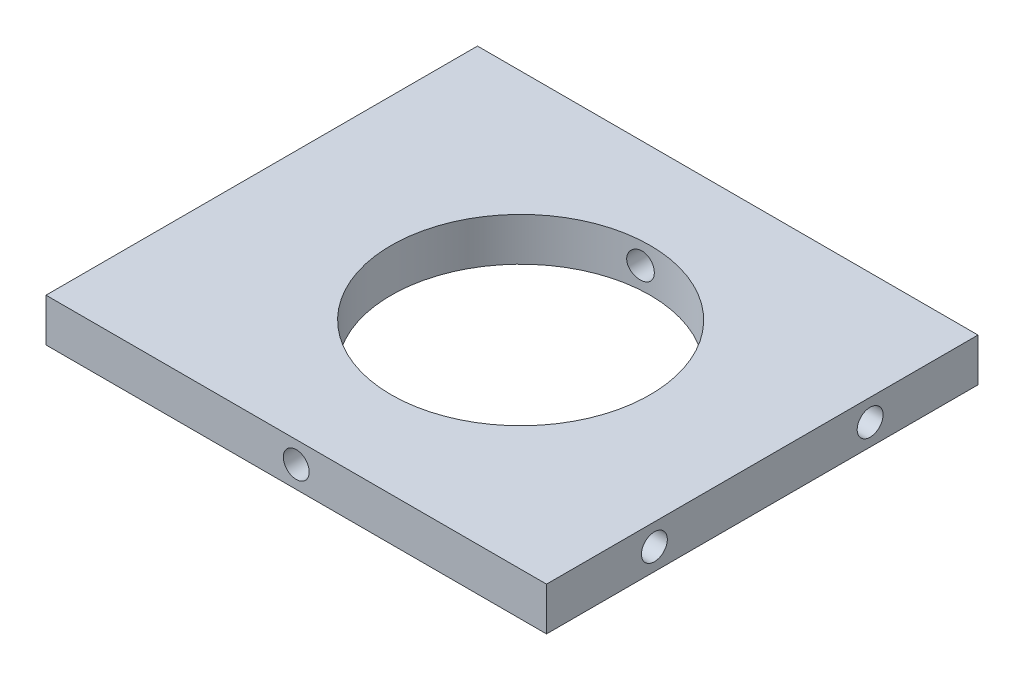
ISO-10303-21;
HEADER;
FILE_DESCRIPTION(('STEP AP214'),'2;1');
FILE_NAME('part.step','',(''),(''),'','','');
FILE_SCHEMA(('AUTOMOTIVE_DESIGN { 1 0 10303 214 1 1 1 1 }'));
ENDSEC;
DATA;
#1=APPLICATION_CONTEXT('core data for automotive mechanical design processes');
#2=APPLICATION_PROTOCOL_DEFINITION('international standard','automotive_design',2000,#1);
#3=PRODUCT_CONTEXT('',#1,'mechanical');
#4=PRODUCT('Part','Part','',(#3));
#5=PRODUCT_RELATED_PRODUCT_CATEGORY('part','',(#4));
#6=PRODUCT_DEFINITION_FORMATION('','',#4);
#7=PRODUCT_DEFINITION_CONTEXT('part definition',#1,'design');
#8=PRODUCT_DEFINITION('design','',#6,#7);
#9=PRODUCT_DEFINITION_SHAPE('','',#8);
#10=(LENGTH_UNIT() NAMED_UNIT(*) SI_UNIT(.MILLI.,.METRE.));
#11=(NAMED_UNIT(*) PLANE_ANGLE_UNIT() SI_UNIT($,.RADIAN.));
#12=(NAMED_UNIT(*) SI_UNIT($,.STERADIAN.) SOLID_ANGLE_UNIT());
#13=UNCERTAINTY_MEASURE_WITH_UNIT(LENGTH_MEASURE(1.E-05),#10,'distance_accuracy_value','');
#14=(GEOMETRIC_REPRESENTATION_CONTEXT(3) GLOBAL_UNCERTAINTY_ASSIGNED_CONTEXT((#13)) GLOBAL_UNIT_ASSIGNED_CONTEXT((#10,
#11,#12)) REPRESENTATION_CONTEXT('',''));
#15=CARTESIAN_POINT('',(0.,0.,0.));
#16=DIRECTION('',(0.,0.,1.));
#17=DIRECTION('',(1.,0.,0.));
#18=AXIS2_PLACEMENT_3D('',#15,#16,#17);
#19=CARTESIAN_POINT('',(-5.5,-45.,50.));
#20=DIRECTION('',(1.,0.,0.));
#21=DIRECTION('',(0.,0.,-1.));
#22=AXIS2_PLACEMENT_3D('',#19,#20,#21);
#23=PLANE('',#22);
#24=CARTESIAN_POINT('',(-5.5,-47.5,12.5));
#25=DIRECTION('',(-1.,0.,0.));
#26=DIRECTION('',(0.,0.,1.));
#27=AXIS2_PLACEMENT_3D('',#24,#25,#26);
#28=CIRCLE('',#27,1.5);
#29=CARTESIAN_POINT('',(-5.5,-47.5,14.));
#30=VERTEX_POINT('',#29);
#31=EDGE_CURVE('E195',#30,#30,#28,.T.);
#32=ORIENTED_EDGE('',*,*,#31,.F.);
#33=EDGE_LOOP('',(#32));
#34=FACE_BOUND('',#33,.T.);
#35=CARTESIAN_POINT('',(-5.5,-47.5,37.5));
#36=DIRECTION('',(-1.,0.,0.));
#37=DIRECTION('',(0.,0.,1.));
#38=AXIS2_PLACEMENT_3D('',#35,#36,#37);
#39=CIRCLE('',#38,1.5);
#40=CARTESIAN_POINT('',(-5.5,-47.5,39.));
#41=VERTEX_POINT('',#40);
#42=EDGE_CURVE('E198',#41,#41,#39,.T.);
#43=ORIENTED_EDGE('',*,*,#42,.F.);
#44=EDGE_LOOP('',(#43));
#45=FACE_BOUND('',#44,.T.);
#46=DIRECTION('',(0.,-1.,0.));
#47=VECTOR('',#46,1.);
#48=CARTESIAN_POINT('',(-5.5,-45.,0.));
#49=LINE('',#48,#47);
#50=CARTESIAN_POINT('',(-5.5,-45.,0.));
#51=VERTEX_POINT('',#50);
#52=CARTESIAN_POINT('',(-5.5,-50.,0.));
#53=VERTEX_POINT('',#52);
#54=EDGE_CURVE('E114',#51,#53,#49,.T.);
#55=ORIENTED_EDGE('',*,*,#54,.T.);
#56=DIRECTION('',(0.,0.,-1.));
#57=VECTOR('',#56,1.);
#58=CARTESIAN_POINT('',(-5.5,-50.,50.));
#59=LINE('',#58,#57);
#60=CARTESIAN_POINT('',(-5.5,-50.,50.));
#61=VERTEX_POINT('',#60);
#62=EDGE_CURVE('E11',#61,#53,#59,.T.);
#63=ORIENTED_EDGE('',*,*,#62,.F.);
#64=DIRECTION('',(0.,-1.,0.));
#65=VECTOR('',#64,1.);
#66=CARTESIAN_POINT('',(-5.5,-45.,50.));
#67=LINE('',#66,#65);
#68=CARTESIAN_POINT('',(-5.5,-45.,50.));
#69=VERTEX_POINT('',#68);
#70=EDGE_CURVE('E95',#69,#61,#67,.T.);
#71=ORIENTED_EDGE('',*,*,#70,.F.);
#72=DIRECTION('',(0.,0.,-1.));
#73=VECTOR('',#72,1.);
#74=CARTESIAN_POINT('',(-5.5,-45.,50.));
#75=LINE('',#74,#73);
#76=EDGE_CURVE('E62',#69,#51,#75,.T.);
#77=ORIENTED_EDGE('',*,*,#76,.T.);
#78=EDGE_LOOP('',(#55,#63,#71,#77));
#79=FACE_BOUND('',#78,.T.);
#80=ADVANCED_FACE('F38',(#34,#45,#79),#23,.F.);
#81=CARTESIAN_POINT('',(-5.5,-50.,50.));
#82=DIRECTION('',(0.,1.,0.));
#83=DIRECTION('',(0.,0.,1.));
#84=AXIS2_PLACEMENT_3D('',#81,#82,#83);
#85=PLANE('',#84);
#86=CARTESIAN_POINT('',(24.5,-50.,25.));
#87=DIRECTION('',(0.,1.,0.));
#88=DIRECTION('',(0.,0.,1.));
#89=AXIS2_PLACEMENT_3D('',#86,#87,#88);
#90=CIRCLE('',#89,15.);
#91=CARTESIAN_POINT('',(24.5,-50.,40.));
#92=VERTEX_POINT('',#91);
#93=EDGE_CURVE('E117',#92,#92,#90,.T.);
#94=ORIENTED_EDGE('',*,*,#93,.T.);
#95=EDGE_LOOP('',(#94));
#96=FACE_BOUND('',#95,.T.);
#97=DIRECTION('',(1.,0.,0.));
#98=VECTOR('',#97,1.);
#99=CARTESIAN_POINT('',(-5.5,-50.,0.));
#100=LINE('',#99,#98);
#101=CARTESIAN_POINT('',(52.5,-50.,0.));
#102=VERTEX_POINT('',#101);
#103=EDGE_CURVE('E101',#53,#102,#100,.T.);
#104=ORIENTED_EDGE('',*,*,#103,.T.);
#105=DIRECTION('',(0.,0.,-1.));
#106=VECTOR('',#105,1.);
#107=CARTESIAN_POINT('',(52.5,-50.,50.));
#108=LINE('',#107,#106);
#109=CARTESIAN_POINT('',(52.5,-50.,50.));
#110=VERTEX_POINT('',#109);
#111=EDGE_CURVE('E53',#110,#102,#108,.T.);
#112=ORIENTED_EDGE('',*,*,#111,.F.);
#113=DIRECTION('',(1.,0.,0.));
#114=VECTOR('',#113,1.);
#115=CARTESIAN_POINT('',(-5.5,-50.,50.));
#116=LINE('',#115,#114);
#117=EDGE_CURVE('E87',#61,#110,#116,.T.);
#118=ORIENTED_EDGE('',*,*,#117,.F.);
#119=ORIENTED_EDGE('',*,*,#62,.T.);
#120=EDGE_LOOP('',(#104,#112,#118,#119));
#121=FACE_BOUND('',#120,.T.);
#122=ADVANCED_FACE('F100',(#96,#121),#85,.F.);
#123=CARTESIAN_POINT('',(52.5,-45.,50.));
#124=DIRECTION('',(1.,0.,0.));
#125=DIRECTION('',(0.,0.,-1.));
#126=AXIS2_PLACEMENT_3D('',#123,#124,#125);
#127=PLANE('',#126);
#128=CARTESIAN_POINT('',(52.5,-47.5,37.5));
#129=DIRECTION('',(1.,0.,0.));
#130=DIRECTION('',(0.,0.,-1.));
#131=AXIS2_PLACEMENT_3D('',#128,#129,#130);
#132=CIRCLE('',#131,1.5);
#133=CARTESIAN_POINT('',(52.5,-47.5,36.));
#134=VERTEX_POINT('',#133);
#135=EDGE_CURVE('E232',#134,#134,#132,.T.);
#136=ORIENTED_EDGE('',*,*,#135,.F.);
#137=EDGE_LOOP('',(#136));
#138=FACE_BOUND('',#137,.T.);
#139=CARTESIAN_POINT('',(52.5,-47.5,12.5));
#140=DIRECTION('',(1.,0.,0.));
#141=DIRECTION('',(0.,0.,-1.));
#142=AXIS2_PLACEMENT_3D('',#139,#140,#141);
#143=CIRCLE('',#142,1.5);
#144=CARTESIAN_POINT('',(52.5,-47.5,11.));
#145=VERTEX_POINT('',#144);
#146=EDGE_CURVE('E240',#145,#145,#143,.T.);
#147=ORIENTED_EDGE('',*,*,#146,.F.);
#148=EDGE_LOOP('',(#147));
#149=FACE_BOUND('',#148,.T.);
#150=DIRECTION('',(0.,-1.,0.));
#151=VECTOR('',#150,1.);
#152=CARTESIAN_POINT('',(52.5,-45.,0.));
#153=LINE('',#152,#151);
#154=CARTESIAN_POINT('',(52.5,-45.,0.));
#155=VERTEX_POINT('',#154);
#156=EDGE_CURVE('E120',#155,#102,#153,.T.);
#157=ORIENTED_EDGE('',*,*,#156,.F.);
#158=DIRECTION('',(0.,0.,-1.));
#159=VECTOR('',#158,1.);
#160=CARTESIAN_POINT('',(52.5,-45.,50.));
#161=LINE('',#160,#159);
#162=CARTESIAN_POINT('',(52.5,-45.,50.));
#163=VERTEX_POINT('',#162);
#164=EDGE_CURVE('E76',#163,#155,#161,.T.);
#165=ORIENTED_EDGE('',*,*,#164,.F.);
#166=DIRECTION('',(0.,-1.,0.));
#167=VECTOR('',#166,1.);
#168=CARTESIAN_POINT('',(52.5,-45.,50.));
#169=LINE('',#168,#167);
#170=EDGE_CURVE('E94',#163,#110,#169,.T.);
#171=ORIENTED_EDGE('',*,*,#170,.T.);
#172=ORIENTED_EDGE('',*,*,#111,.T.);
#173=EDGE_LOOP('',(#157,#165,#171,#172));
#174=FACE_BOUND('',#173,.T.);
#175=ADVANCED_FACE('F106',(#138,#149,#174),#127,.T.);
#176=CARTESIAN_POINT('',(-5.5,-45.,50.));
#177=DIRECTION('',(0.,1.,0.));
#178=DIRECTION('',(0.,0.,1.));
#179=AXIS2_PLACEMENT_3D('',#176,#177,#178);
#180=PLANE('',#179);
#181=CARTESIAN_POINT('',(24.5,-45.,25.));
#182=DIRECTION('',(0.,1.,0.));
#183=DIRECTION('',(0.,0.,1.));
#184=AXIS2_PLACEMENT_3D('',#181,#182,#183);
#185=CIRCLE('',#184,15.);
#186=CARTESIAN_POINT('',(24.5,-45.,40.));
#187=VERTEX_POINT('',#186);
#188=EDGE_CURVE('E248',#187,#187,#185,.T.);
#189=ORIENTED_EDGE('',*,*,#188,.F.);
#190=EDGE_LOOP('',(#189));
#191=FACE_BOUND('',#190,.T.);
#192=DIRECTION('',(1.,0.,0.));
#193=VECTOR('',#192,1.);
#194=CARTESIAN_POINT('',(-5.5,-45.,0.));
#195=LINE('',#194,#193);
#196=EDGE_CURVE('E123',#51,#155,#195,.T.);
#197=ORIENTED_EDGE('',*,*,#196,.F.);
#198=ORIENTED_EDGE('',*,*,#76,.F.);
#199=DIRECTION('',(1.,0.,0.));
#200=VECTOR('',#199,1.);
#201=CARTESIAN_POINT('',(-5.5,-45.,50.));
#202=LINE('',#201,#200);
#203=EDGE_CURVE('E108',#69,#163,#202,.T.);
#204=ORIENTED_EDGE('',*,*,#203,.T.);
#205=ORIENTED_EDGE('',*,*,#164,.T.);
#206=EDGE_LOOP('',(#197,#198,#204,#205));
#207=FACE_BOUND('',#206,.T.);
#208=ADVANCED_FACE('F200',(#191,#207),#180,.T.);
#209=CARTESIAN_POINT('',(0.,0.,50.));
#210=DIRECTION('',(0.,0.,1.));
#211=DIRECTION('',(1.,0.,0.));
#212=AXIS2_PLACEMENT_3D('',#209,#210,#211);
#213=PLANE('',#212);
#214=CARTESIAN_POINT('',(23.5,-47.5,50.));
#215=DIRECTION('',(0.,0.,1.));
#216=DIRECTION('',(1.,0.,0.));
#217=AXIS2_PLACEMENT_3D('',#214,#215,#216);
#218=CIRCLE('',#217,1.5);
#219=CARTESIAN_POINT('',(25.,-47.5,50.));
#220=VERTEX_POINT('',#219);
#221=EDGE_CURVE('E222',#220,#220,#218,.T.);
#222=ORIENTED_EDGE('',*,*,#221,.F.);
#223=EDGE_LOOP('',(#222));
#224=FACE_BOUND('',#223,.T.);
#225=ORIENTED_EDGE('',*,*,#70,.T.);
#226=ORIENTED_EDGE('',*,*,#117,.T.);
#227=ORIENTED_EDGE('',*,*,#170,.F.);
#228=ORIENTED_EDGE('',*,*,#203,.F.);
#229=EDGE_LOOP('',(#225,#226,#227,#228));
#230=FACE_BOUND('',#229,.T.);
#231=ADVANCED_FACE('F91',(#224,#230),#213,.T.);
#232=CARTESIAN_POINT('',(0.,0.,0.));
#233=DIRECTION('',(0.,0.,1.));
#234=DIRECTION('',(1.,0.,0.));
#235=AXIS2_PLACEMENT_3D('',#232,#233,#234);
#236=PLANE('',#235);
#237=CARTESIAN_POINT('',(23.5,-47.5,0.));
#238=DIRECTION('',(0.,0.,1.));
#239=DIRECTION('',(1.,0.,0.));
#240=AXIS2_PLACEMENT_3D('',#237,#238,#239);
#241=CIRCLE('',#240,1.5);
#242=CARTESIAN_POINT('',(25.,-47.5,0.));
#243=VERTEX_POINT('',#242);
#244=EDGE_CURVE('E136',#243,#243,#241,.T.);
#245=ORIENTED_EDGE('',*,*,#244,.T.);
#246=EDGE_LOOP('',(#245));
#247=FACE_BOUND('',#246,.T.);
#248=ORIENTED_EDGE('',*,*,#54,.F.);
#249=ORIENTED_EDGE('',*,*,#196,.T.);
#250=ORIENTED_EDGE('',*,*,#156,.T.);
#251=ORIENTED_EDGE('',*,*,#103,.F.);
#252=EDGE_LOOP('',(#248,#249,#250,#251));
#253=FACE_BOUND('',#252,.T.);
#254=ADVANCED_FACE('F182',(#247,#253),#236,.F.);
#255=CARTESIAN_POINT('',(24.5,-50.,25.));
#256=DIRECTION('',(0.,1.,0.));
#257=DIRECTION('',(0.,0.,1.));
#258=AXIS2_PLACEMENT_3D('',#255,#256,#257);
#259=CYLINDRICAL_SURFACE('',#258,15.);
#260=CARTESIAN_POINT('',(24.5,-48.6180339887499,40.));
#261=CARTESIAN_POINT('',(24.562792353238,-48.5618659776974,39.9999999273094));
#262=CARTESIAN_POINT('',(24.6208838158503,-48.5003581564799,39.9996043563319));
#263=CARTESIAN_POINT('',(24.72595981168,-48.3684181847015,39.9983905695386));
#264=CARTESIAN_POINT('',(24.772931785864,-48.2979760797655,39.9975718791152));
#265=CARTESIAN_POINT('',(24.8543649479623,-48.1502338072453,39.99586905058));
#266=CARTESIAN_POINT('',(24.8888319928025,-48.0729368714198,39.9949849433416));
#267=CARTESIAN_POINT('',(24.9442939822402,-47.9136720731185,39.9934445105049));
#268=CARTESIAN_POINT('',(24.9652921021757,-47.8317053165315,39.9927881312359));
#269=CARTESIAN_POINT('',(24.9932381044238,-47.6653852355015,39.991894956042));
#270=CARTESIAN_POINT('',(25.0001822524607,-47.5810312827931,39.9916582716361));
#271=CARTESIAN_POINT('',(24.9998104507153,-47.4123520030367,39.9916706731326));
#272=CARTESIAN_POINT('',(24.9924940082127,-47.3280266770783,39.9919197758194));
#273=CARTESIAN_POINT('',(24.9638161431028,-47.1618456026428,39.9928341984516));
#274=CARTESIAN_POINT('',(24.9424617981782,-47.0799886314014,39.9934993086447));
#275=CARTESIAN_POINT('',(24.8863217141132,-46.9210199569291,39.9950504711979));
#276=CARTESIAN_POINT('',(24.8515359006039,-46.8439082799752,39.9959365247814));
#277=CARTESIAN_POINT('',(24.7694988309606,-46.6965791515574,39.9976347173306));
#278=CARTESIAN_POINT('',(24.7222416725437,-46.6263649861102,39.9984468210528));
#279=CARTESIAN_POINT('',(24.6166083457938,-46.4948639816127,39.9996394624362));
#280=CARTESIAN_POINT('',(24.5582322156506,-46.4335771119016,40.0000200015798));
#281=CARTESIAN_POINT('',(24.4320393526911,-46.3216914820977,39.9999784211476));
#282=CARTESIAN_POINT('',(24.3642257106856,-46.2710892363641,39.9995565637883));
#283=CARTESIAN_POINT('',(24.2210799042835,-46.1819898565089,39.9975771087919));
#284=CARTESIAN_POINT('',(24.1457478960958,-46.1434924709536,39.9960195347473));
#285=CARTESIAN_POINT('',(23.9899180446766,-46.0797715112282,39.9915266586073));
#286=CARTESIAN_POINT('',(23.9094332194227,-46.0545158613062,39.988594718639));
#287=CARTESIAN_POINT('',(23.7454392678804,-46.0178328573119,39.9812339758208));
#288=CARTESIAN_POINT('',(23.6619301757651,-46.0064053470377,39.9768051898798));
#289=CARTESIAN_POINT('',(23.4943230369783,-45.9976665937383,39.9664845056108));
#290=CARTESIAN_POINT('',(23.4102254049045,-46.0003462508765,39.9605935527908));
#291=CARTESIAN_POINT('',(23.2437533596228,-46.0196756779531,39.9475355154578));
#292=CARTESIAN_POINT('',(23.1613790012947,-46.0363258921081,39.9403683903723));
#293=CARTESIAN_POINT('',(23.0002148174492,-46.0832096888632,39.9250539333135));
#294=CARTESIAN_POINT('',(22.9214460800378,-46.1135141218067,39.9169016530286));
#295=CARTESIAN_POINT('',(22.770129740452,-46.1868514276487,39.9001124404489));
#296=CARTESIAN_POINT('',(22.6975824694957,-46.2298849776771,39.8914754823913));
#297=CARTESIAN_POINT('',(22.560210733606,-46.3278382495193,39.8742075878157));
#298=CARTESIAN_POINT('',(22.4954454068788,-46.3828410293132,39.865577139024));
#299=CARTESIAN_POINT('',(22.3760681607444,-46.5030290060947,39.8489916746371));
#300=CARTESIAN_POINT('',(22.321456317729,-46.5682142796855,39.841036664124));
#301=CARTESIAN_POINT('',(22.2239861605324,-46.7069241677782,39.8264020065275));
#302=CARTESIAN_POINT('',(22.1811210921386,-46.780443955538,39.8197216272249));
#303=CARTESIAN_POINT('',(22.1083830987965,-46.9337829426933,39.8081576293496));
#304=CARTESIAN_POINT('',(22.0785092560552,-47.0136016966138,39.8032738838537));
#305=CARTESIAN_POINT('',(22.0329217592396,-47.1763550590977,39.7957445669148));
#306=CARTESIAN_POINT('',(22.0170587060804,-47.2592467230113,39.793075400165));
#307=CARTESIAN_POINT('',(21.99944001645,-47.4265556839183,39.7901075765534));
#308=CARTESIAN_POINT('',(21.9976833974087,-47.5109728742422,39.7898087545877));
#309=CARTESIAN_POINT('',(22.0082758882822,-47.6780268937381,39.7915968474477));
#310=CARTESIAN_POINT('',(22.0204820432474,-47.7606730965288,39.7936595841268));
#311=CARTESIAN_POINT('',(22.0583925626577,-47.9227202250515,39.7999634598376));
#312=CARTESIAN_POINT('',(22.0840970129419,-48.0021211301425,39.8042046127225));
#313=CARTESIAN_POINT('',(22.1483032340545,-48.1556317105165,39.8145393271029));
#314=CARTESIAN_POINT('',(22.1868319027658,-48.2297298633808,39.8206367797408));
#315=CARTESIAN_POINT('',(22.2755567105231,-48.3704352687845,39.8342124511775));
#316=CARTESIAN_POINT('',(22.3257536560549,-48.4370420030609,39.8416907654112));
#317=CARTESIAN_POINT('',(22.4370693925022,-48.5617176741496,39.8575740693727));
#318=CARTESIAN_POINT('',(22.4983104849109,-48.6196761614701,39.8659889844142));
#319=CARTESIAN_POINT('',(22.6296001439708,-48.7245254908278,39.8830769488825));
#320=CARTESIAN_POINT('',(22.6996492013782,-48.7714157157517,39.891750012672));
#321=CARTESIAN_POINT('',(22.8472614104589,-48.8531855360378,39.9088569265127));
#322=CARTESIAN_POINT('',(22.9248835810385,-48.8879592273636,39.9172881037536));
#323=CARTESIAN_POINT('',(23.0849570892867,-48.943927864651,39.9333223956186));
#324=CARTESIAN_POINT('',(23.1674082006577,-48.965123446366,39.9409255489985));
#325=CARTESIAN_POINT('',(23.3346056759678,-48.9932561545366,39.9548946501727));
#326=CARTESIAN_POINT('',(23.4193460068746,-49.0002276394919,39.9612635455413));
#327=CARTESIAN_POINT('',(23.588904796731,-48.9997610144627,39.9725456864663));
#328=CARTESIAN_POINT('',(23.6737232670143,-48.9923203055756,39.9774586692985));
#329=CARTESIAN_POINT('',(23.8403540340811,-48.9633056593774,39.9857192995042));
#330=CARTESIAN_POINT('',(23.9221834167737,-48.9418325836234,39.9890778278578));
#331=CARTESIAN_POINT('',(24.0810523350006,-48.8854484515661,39.9943586171885));
#332=CARTESIAN_POINT('',(24.1580971248861,-48.8505524503972,39.9962824802054));
#333=CARTESIAN_POINT('',(24.2797029674199,-48.7826155745908,39.9984597880573));
#334=CARTESIAN_POINT('',(24.3262741867071,-48.7531165454756,39.9990609731497));
#335=CARTESIAN_POINT('',(24.4158998136255,-48.6891835492231,39.9998311023475));
#336=CARTESIAN_POINT('',(24.4589542299064,-48.654749594224,40.000000047516));
#337=CARTESIAN_POINT('',(24.5,-48.6180339887499,40.));
#338=B_SPLINE_CURVE_WITH_KNOTS('',3,(#260,#261,#262,#263,#264,#265,#266,#267,#268,#269,#270,
#271,#272,#273,#274,#275,#276,#277,#278,#279,#280,#281,#282,#283,#284,#285,#286,#287,#288,#289,
#290,#291,#292,#293,#294,#295,#296,#297,#298,#299,#300,#301,#302,#303,#304,#305,#306,#307,#308,
#309,#310,#311,#312,#313,#314,#315,#316,#317,#318,#319,#320,#321,#322,#323,#324,#325,#326,#327,
#328,#329,#330,#331,#332,#333,#334,#335,#336,#337),.UNSPECIFIED.,.T.,.F.,(4,2,2,2,2,2,2,2,2,2,2,
2,2,2,2,2,2,2,2,2,2,2,2,2,2,2,2,2,2,2,2,2,2,2,2,2,2,2,4),(0.,0.252543206012552,
0.505370303251981,0.758078830685047,1.0107277594349,1.2634438106295,1.51616859361576,
1.76876605449305,2.02136491400379,2.2740835354169,2.5268012888428,2.77943647043873,
3.03206640412767,3.28408152599207,3.53609380108175,3.78794353543168,4.03980127805724,
4.29298120960288,4.54617461156697,4.80118445355844,5.05619621408953,5.31106103770037,
5.56590785291206,5.81800319874273,6.07008098496437,6.3196008486299,6.56912229907351,
6.81917043593607,7.06923586072356,7.32226266989589,7.57530358329969,7.83050375721573,
8.08569198129116,8.34026306146166,8.59488005185742,8.84768674836169,9.1002107201396,
9.26529222026118,9.43037331434599),.UNSPECIFIED.);
#339=CARTESIAN_POINT('',(24.5,-48.6180339887499,40.));
#340=VERTEX_POINT('',#339);
#341=EDGE_CURVE('E41',#340,#340,#338,.T.);
#342=ORIENTED_EDGE('',*,*,#341,.T.);
#343=EDGE_LOOP('',(#342));
#344=FACE_BOUND('',#343,.T.);
#345=CARTESIAN_POINT('',(25.,-47.5,10.0083356494351));
#346=CARTESIAN_POINT('',(24.9999964070791,-47.5842499744961,10.0083349118921));
#347=CARTESIAN_POINT('',(24.9928786229047,-47.6685554591201,10.0080928964742));
#348=CARTESIAN_POINT('',(24.964585862334,-47.8348368758247,10.0071899661793));
#349=CARTESIAN_POINT('',(24.9433954392273,-47.9168101447469,10.0065285910318));
#350=CARTESIAN_POINT('',(24.8875624354346,-48.0760027863067,10.0049818002119));
#351=CARTESIAN_POINT('',(24.8529260300543,-48.1532243224277,10.0040964874517));
#352=CARTESIAN_POINT('',(24.7711906244292,-48.3007398392809,10.0023962417037));
#353=CARTESIAN_POINT('',(24.7240943522341,-48.3710353318311,10.0015812933617));
#354=CARTESIAN_POINT('',(24.6187504122749,-48.5027518519266,10.0003778129088));
#355=CARTESIAN_POINT('',(24.5604987516729,-48.5641696880463,9.99998943381575));
#356=CARTESIAN_POINT('',(24.434507814437,-48.676354536589,10.0000109816476));
#357=CARTESIAN_POINT('',(24.3667683329315,-48.7271213189636,10.0004209258132));
#358=CARTESIAN_POINT('',(24.2238475421744,-48.8164865821728,10.002372459673));
#359=CARTESIAN_POINT('',(24.1486777588008,-48.8551035323155,10.0039123197582));
#360=CARTESIAN_POINT('',(23.9929648679635,-48.9191805397952,10.0083698173944));
#361=CARTESIAN_POINT('',(23.9124218871837,-48.9446409072012,10.0112874224723));
#362=CARTESIAN_POINT('',(23.7484626265013,-48.9816590937206,10.0186146503521));
#363=CARTESIAN_POINT('',(23.6650533204193,-48.9932484953246,10.0230208543269));
#364=CARTESIAN_POINT('',(23.4975616761401,-49.0023409897194,10.0332984041684));
#365=CARTESIAN_POINT('',(23.4134793331329,-48.999843981751,10.039169760515));
#366=CARTESIAN_POINT('',(23.2468303259933,-48.9808623951708,10.0522052435257));
#367=CARTESIAN_POINT('',(23.1642672811478,-48.964347964132,10.0593721035229));
#368=CARTESIAN_POINT('',(23.0031360135907,-48.9178010130177,10.0746540147077));
#369=CARTESIAN_POINT('',(22.9245679894165,-48.8877678218399,10.0827691129532));
#370=CARTESIAN_POINT('',(22.7730326409861,-48.8147784316545,10.0995489048332));
#371=CARTESIAN_POINT('',(22.7001102670412,-48.7717297203582,10.1082171702816));
#372=CARTESIAN_POINT('',(22.5625230627467,-48.6739924742659,10.1254916537007));
#373=CARTESIAN_POINT('',(22.4978585586007,-48.6193034798808,10.1340978692076));
#374=CARTESIAN_POINT('',(22.3783275317526,-48.4995203950834,10.150684497705));
#375=CARTESIAN_POINT('',(22.3235057991697,-48.4343811723877,10.1586619616392));
#376=CARTESIAN_POINT('',(22.2255992728763,-48.2956806912995,10.1733496612181));
#377=CARTESIAN_POINT('',(22.1825140802637,-48.2221197192668,10.1800599399295));
#378=CARTESIAN_POINT('',(22.1095940560411,-48.0691284897229,10.1916469238612));
#379=CARTESIAN_POINT('',(22.079678420917,-47.9897376134946,10.1965347816167));
#380=CARTESIAN_POINT('',(22.0336262357457,-47.8269569407916,10.2041373774506));
#381=CARTESIAN_POINT('',(22.0174885245848,-47.7435674819169,10.2068522986485));
#382=CARTESIAN_POINT('',(21.9996083541071,-47.5762606684606,10.2098639676322));
#383=CARTESIAN_POINT('',(21.9976906259962,-47.4923625426949,10.2101901571722));
#384=CARTESIAN_POINT('',(22.0078468602156,-47.3254445552735,10.2084754541555));
#385=CARTESIAN_POINT('',(22.0199203263891,-47.2424246625792,10.2064346455375));
#386=CARTESIAN_POINT('',(22.057592616999,-47.0800286158017,10.2001687729347));
#387=CARTESIAN_POINT('',(22.0831256395972,-47.0006367591001,10.195954337645));
#388=CARTESIAN_POINT('',(22.1469139028716,-46.8472699010219,10.1856818108152));
#389=CARTESIAN_POINT('',(22.1851697019454,-46.7732951375733,10.1796236383551));
#390=CARTESIAN_POINT('',(22.2736637376209,-46.6321914641037,10.1660713405851));
#391=CARTESIAN_POINT('',(22.3239978197091,-46.5651237790124,10.1585658287659));
#392=CARTESIAN_POINT('',(22.435056545862,-46.4403430265539,10.1427072603237));
#393=CARTESIAN_POINT('',(22.4957819324904,-46.382630628291,10.134354143148));
#394=CARTESIAN_POINT('',(22.6267295205059,-46.2774895199334,10.1172831628314));
#395=CARTESIAN_POINT('',(22.6970558595432,-46.2301909602199,10.108562147777));
#396=CARTESIAN_POINT('',(22.8446886983902,-46.1480746776261,10.0914299780804));
#397=CARTESIAN_POINT('',(22.9219953528398,-46.1132572313339,10.0830188303088));
#398=CARTESIAN_POINT('',(23.0817010882264,-46.0570114582542,10.0669867808902));
#399=CARTESIAN_POINT('',(23.1641158652917,-46.0356269020312,10.0593685294464));
#400=CARTESIAN_POINT('',(23.3314742510669,-46.0070819947215,10.045348713314));
#401=CARTESIAN_POINT('',(23.4164177705751,-45.9999211424935,10.0389471057668));
#402=CARTESIAN_POINT('',(23.5858632296555,-46.0000796785806,10.0276414770769));
#403=CARTESIAN_POINT('',(23.6703646469688,-46.0073096865453,10.0227284289871));
#404=CARTESIAN_POINT('',(23.8370168480058,-46.0359075993195,10.0144264124061));
#405=CARTESIAN_POINT('',(23.9191677145388,-46.0572750054307,10.0110373901618));
#406=CARTESIAN_POINT('',(24.0782304210052,-46.1133792679393,10.0057207958412));
#407=CARTESIAN_POINT('',(24.1551721893493,-46.1480304541184,10.0037840892962));
#408=CARTESIAN_POINT('',(24.3021816974751,-46.2297339255415,10.0011240588822));
#409=CARTESIAN_POINT('',(24.3722496903044,-46.2767857540393,10.0004006903302));
#410=CARTESIAN_POINT('',(24.5034826553979,-46.3819265299989,9.99985668507682));
#411=CARTESIAN_POINT('',(24.5646526941452,-46.4400091527555,10.0000355325684));
#412=CARTESIAN_POINT('',(24.6764234915456,-46.5656043426042,10.0009331117728));
#413=CARTESIAN_POINT('',(24.7270217293246,-46.6331191524368,10.0016519720657));
#414=CARTESIAN_POINT('',(24.8163363499664,-46.7758655243833,10.0032690639773));
#415=CARTESIAN_POINT('',(24.8550172869752,-46.8511192357595,10.0041678178249));
#416=CARTESIAN_POINT('',(24.9191674252937,-47.0069967043803,10.0058232114384));
#417=CARTESIAN_POINT('',(24.9446510245009,-47.0876145007113,10.0065800055005));
#418=CARTESIAN_POINT('',(24.9754165237885,-47.2238936448003,10.0075312318259));
#419=CARTESIAN_POINT('',(24.984623040384,-47.2787004113771,10.0078294138403));
#420=CARTESIAN_POINT('',(24.9969159623042,-47.3889967516666,10.0082318656374));
#421=CARTESIAN_POINT('',(25.0000023674339,-47.444486325401,10.008336135414));
#422=CARTESIAN_POINT('',(25.,-47.5,10.0083356494351));
#423=B_SPLINE_CURVE_WITH_KNOTS('',3,(#345,#346,#347,#348,#349,#350,#351,#352,#353,#354,#355,
#356,#357,#358,#359,#360,#361,#362,#363,#364,#365,#366,#367,#368,#369,#370,#371,#372,#373,#374,
#375,#376,#377,#378,#379,#380,#381,#382,#383,#384,#385,#386,#387,#388,#389,#390,#391,#392,#393,
#394,#395,#396,#397,#398,#399,#400,#401,#402,#403,#404,#405,#406,#407,#408,#409,#410,#411,#412,
#413,#414,#415,#416,#417,#418,#419,#420,#421,#422),.UNSPECIFIED.,.T.,.F.,(4,2,2,2,2,2,2,2,2,2,2,
2,2,2,2,2,2,2,2,2,2,2,2,2,2,2,2,2,2,2,2,2,2,2,2,2,2,2,4),(0.,0.252547889507815,
0.505373445209825,0.75808302340328,1.01073731732934,1.26348221316865,1.51623256739877,
1.76859683117048,2.02095514705091,2.27273777416927,2.52452220227428,2.77684419635816,
3.02917871766505,3.28335072948649,3.53753277854909,3.7928436976107,4.04814593806547,
4.30185913101079,4.55555094055121,4.80611058428697,5.05666134292843,5.30599840234662,
5.55534640651252,5.80674261789837,6.05815680159315,6.31255422540461,6.56695728644756,
6.82218506780341,7.07740385660325,7.33104245029174,7.58467209732973,7.83669282078757,
8.08870426300024,8.34057164377351,8.59249901462439,8.84516862083349,9.09756198832219,
9.26396988335051,9.43037778368103),.UNSPECIFIED.);
#424=CARTESIAN_POINT('',(25.,-47.5,10.0083356494351));
#425=VERTEX_POINT('',#424);
#426=EDGE_CURVE('E130',#425,#425,#423,.T.);
#427=ORIENTED_EDGE('',*,*,#426,.T.);
#428=EDGE_LOOP('',(#427));
#429=FACE_BOUND('',#428,.T.);
#430=ORIENTED_EDGE('',*,*,#93,.F.);
#431=EDGE_LOOP('',(#430));
#432=FACE_BOUND('',#431,.T.);
#433=ORIENTED_EDGE('',*,*,#188,.T.);
#434=EDGE_LOOP('',(#433));
#435=FACE_BOUND('',#434,.T.);
#436=ADVANCED_FACE('F137',(#344,#429,#432,#435),#259,.F.);
#437=CARTESIAN_POINT('',(4.5,-47.5,37.5));
#438=DIRECTION('',(-1.,0.,0.));
#439=DIRECTION('',(0.,0.,1.));
#440=AXIS2_PLACEMENT_3D('',#437,#438,#439);
#441=CYLINDRICAL_SURFACE('',#440,1.5);
#442=CARTESIAN_POINT('',(4.5,-47.5,37.5));
#443=DIRECTION('',(-1.,0.,0.));
#444=DIRECTION('',(0.,0.,1.));
#445=AXIS2_PLACEMENT_3D('',#442,#443,#444);
#446=CIRCLE('',#445,1.5);
#447=CARTESIAN_POINT('',(4.5,-47.5,39.));
#448=VERTEX_POINT('',#447);
#449=EDGE_CURVE('E251',#448,#448,#446,.T.);
#450=ORIENTED_EDGE('',*,*,#449,.F.);
#451=EDGE_LOOP('',(#450));
#452=FACE_BOUND('',#451,.T.);
#453=ORIENTED_EDGE('',*,*,#42,.T.);
#454=EDGE_LOOP('',(#453));
#455=FACE_BOUND('',#454,.T.);
#456=ADVANCED_FACE('F174',(#452,#455),#441,.F.);
#457=CARTESIAN_POINT('',(4.5,-47.5,37.5));
#458=DIRECTION('',(-1.,0.,0.));
#459=DIRECTION('',(0.,0.,1.));
#460=AXIS2_PLACEMENT_3D('',#457,#458,#459);
#461=PLANE('',#460);
#462=ORIENTED_EDGE('',*,*,#449,.T.);
#463=EDGE_LOOP('',(#462));
#464=FACE_BOUND('',#463,.T.);
#465=ADVANCED_FACE('F171',(#464),#461,.T.);
#466=CARTESIAN_POINT('',(4.5,-47.5,12.5));
#467=DIRECTION('',(-1.,0.,0.));
#468=DIRECTION('',(0.,0.,1.));
#469=AXIS2_PLACEMENT_3D('',#466,#467,#468);
#470=CYLINDRICAL_SURFACE('',#469,1.5);
#471=CARTESIAN_POINT('',(4.5,-47.5,12.5));
#472=DIRECTION('',(-1.,0.,0.));
#473=DIRECTION('',(0.,0.,1.));
#474=AXIS2_PLACEMENT_3D('',#471,#472,#473);
#475=CIRCLE('',#474,1.5);
#476=CARTESIAN_POINT('',(4.5,-47.5,14.));
#477=VERTEX_POINT('',#476);
#478=EDGE_CURVE('E244',#477,#477,#475,.T.);
#479=ORIENTED_EDGE('',*,*,#478,.F.);
#480=EDGE_LOOP('',(#479));
#481=FACE_BOUND('',#480,.T.);
#482=ORIENTED_EDGE('',*,*,#31,.T.);
#483=EDGE_LOOP('',(#482));
#484=FACE_BOUND('',#483,.T.);
#485=ADVANCED_FACE('F167',(#481,#484),#470,.F.);
#486=CARTESIAN_POINT('',(4.5,-47.5,12.5));
#487=DIRECTION('',(-1.,0.,0.));
#488=DIRECTION('',(0.,0.,1.));
#489=AXIS2_PLACEMENT_3D('',#486,#487,#488);
#490=PLANE('',#489);
#491=ORIENTED_EDGE('',*,*,#478,.T.);
#492=EDGE_LOOP('',(#491));
#493=FACE_BOUND('',#492,.T.);
#494=ADVANCED_FACE('F163',(#493),#490,.T.);
#495=CARTESIAN_POINT('',(42.5,-47.5,12.5));
#496=DIRECTION('',(1.,0.,0.));
#497=DIRECTION('',(0.,0.,-1.));
#498=AXIS2_PLACEMENT_3D('',#495,#496,#497);
#499=CYLINDRICAL_SURFACE('',#498,1.5);
#500=CARTESIAN_POINT('',(42.5,-47.5,12.5));
#501=DIRECTION('',(1.,0.,0.));
#502=DIRECTION('',(0.,0.,-1.));
#503=AXIS2_PLACEMENT_3D('',#500,#501,#502);
#504=CIRCLE('',#503,1.5);
#505=CARTESIAN_POINT('',(42.5,-47.5,11.));
#506=VERTEX_POINT('',#505);
#507=EDGE_CURVE('E236',#506,#506,#504,.T.);
#508=ORIENTED_EDGE('',*,*,#507,.F.);
#509=EDGE_LOOP('',(#508));
#510=FACE_BOUND('',#509,.T.);
#511=ORIENTED_EDGE('',*,*,#146,.T.);
#512=EDGE_LOOP('',(#511));
#513=FACE_BOUND('',#512,.T.);
#514=ADVANCED_FACE('F159',(#510,#513),#499,.F.);
#515=CARTESIAN_POINT('',(42.5,-47.5,12.5));
#516=DIRECTION('',(1.,0.,0.));
#517=DIRECTION('',(0.,0.,-1.));
#518=AXIS2_PLACEMENT_3D('',#515,#516,#517);
#519=PLANE('',#518);
#520=ORIENTED_EDGE('',*,*,#507,.T.);
#521=EDGE_LOOP('',(#520));
#522=FACE_BOUND('',#521,.T.);
#523=ADVANCED_FACE('F155',(#522),#519,.T.);
#524=CARTESIAN_POINT('',(42.5,-47.5,37.5));
#525=DIRECTION('',(1.,0.,0.));
#526=DIRECTION('',(0.,0.,-1.));
#527=AXIS2_PLACEMENT_3D('',#524,#525,#526);
#528=CYLINDRICAL_SURFACE('',#527,1.5);
#529=CARTESIAN_POINT('',(42.5,-47.5,37.5));
#530=DIRECTION('',(1.,0.,0.));
#531=DIRECTION('',(0.,0.,-1.));
#532=AXIS2_PLACEMENT_3D('',#529,#530,#531);
#533=CIRCLE('',#532,1.5);
#534=CARTESIAN_POINT('',(42.5,-47.5,36.));
#535=VERTEX_POINT('',#534);
#536=EDGE_CURVE('E228',#535,#535,#533,.T.);
#537=ORIENTED_EDGE('',*,*,#536,.F.);
#538=EDGE_LOOP('',(#537));
#539=FACE_BOUND('',#538,.T.);
#540=ORIENTED_EDGE('',*,*,#135,.T.);
#541=EDGE_LOOP('',(#540));
#542=FACE_BOUND('',#541,.T.);
#543=ADVANCED_FACE('F151',(#539,#542),#528,.F.);
#544=CARTESIAN_POINT('',(42.5,-47.5,37.5));
#545=DIRECTION('',(1.,0.,0.));
#546=DIRECTION('',(0.,0.,-1.));
#547=AXIS2_PLACEMENT_3D('',#544,#545,#546);
#548=PLANE('',#547);
#549=ORIENTED_EDGE('',*,*,#536,.T.);
#550=EDGE_LOOP('',(#549));
#551=FACE_BOUND('',#550,.T.);
#552=ADVANCED_FACE('F147',(#551),#548,.T.);
#553=CARTESIAN_POINT('',(23.5,-47.5,0.));
#554=DIRECTION('',(0.,0.,1.));
#555=DIRECTION('',(1.,0.,0.));
#556=AXIS2_PLACEMENT_3D('',#553,#554,#555);
#557=CYLINDRICAL_SURFACE('',#556,1.5);
#558=ORIENTED_EDGE('',*,*,#244,.F.);
#559=EDGE_LOOP('',(#558));
#560=FACE_BOUND('',#559,.T.);
#561=ORIENTED_EDGE('',*,*,#426,.F.);
#562=EDGE_LOOP('',(#561));
#563=FACE_BOUND('',#562,.T.);
#564=ADVANCED_FACE('F145',(#560,#563),#557,.F.);
#565=ORIENTED_EDGE('',*,*,#221,.T.);
#566=EDGE_LOOP('',(#565));
#567=FACE_BOUND('',#566,.T.);
#568=ORIENTED_EDGE('',*,*,#341,.F.);
#569=EDGE_LOOP('',(#568));
#570=FACE_BOUND('',#569,.T.);
#571=ADVANCED_FACE('F141',(#567,#570),#557,.F.);
#572=CLOSED_SHELL('',(#80,#122,#175,#208,#231,#254,#436,#456,#465,#485,#494,#514,#523,#543,#552,
#564,#571));
#573=MANIFOLD_SOLID_BREP('B2',#572);
#574=ADVANCED_BREP_SHAPE_REPRESENTATION('',(#18,#573),#14);
#575=SHAPE_DEFINITION_REPRESENTATION(#9,#574);
ENDSEC;
END-ISO-10303-21;
